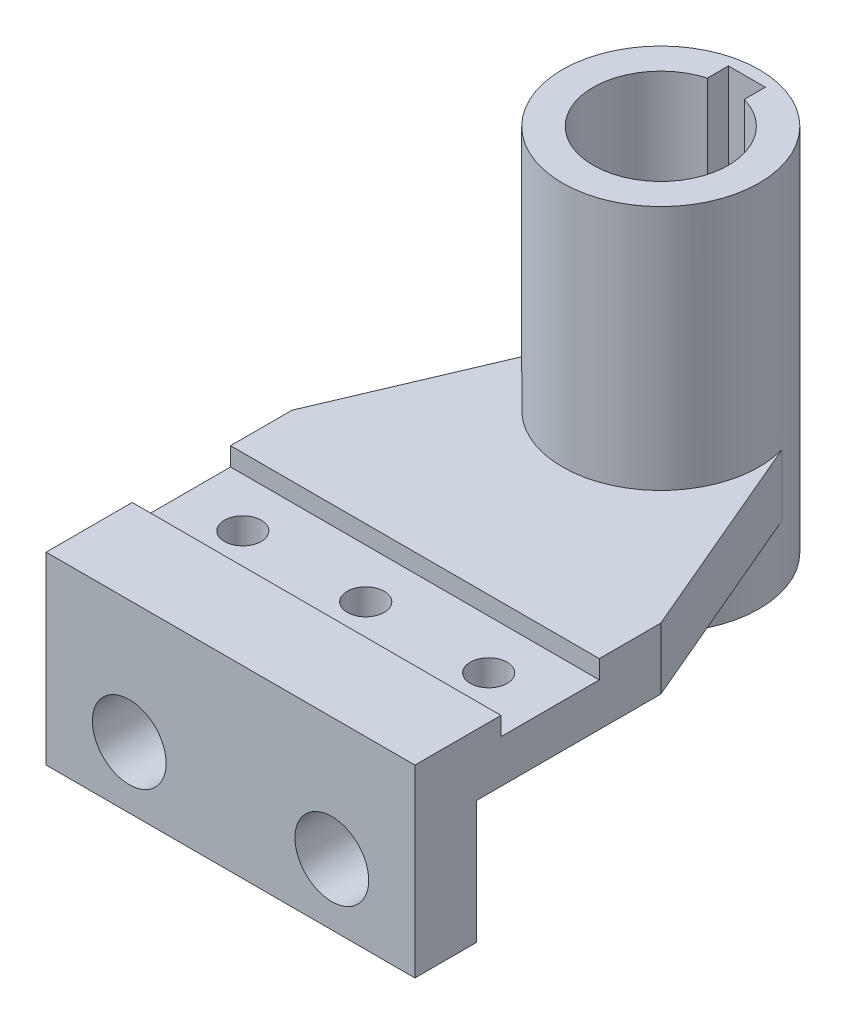
ISO-10303-21;
HEADER;
FILE_DESCRIPTION(('STEP AP214'),'2;1');
FILE_NAME('part.step','',(''),(''),'','','');
FILE_SCHEMA(('AUTOMOTIVE_DESIGN { 1 0 10303 214 1 1 1 1 }'));
ENDSEC;
DATA;
#1=APPLICATION_CONTEXT('core data for automotive mechanical design processes');
#2=APPLICATION_PROTOCOL_DEFINITION('international standard','automotive_design',2000,#1);
#3=PRODUCT_CONTEXT('',#1,'mechanical');
#4=PRODUCT('Part','Part','',(#3));
#5=PRODUCT_RELATED_PRODUCT_CATEGORY('part','',(#4));
#6=PRODUCT_DEFINITION_FORMATION('','',#4);
#7=PRODUCT_DEFINITION_CONTEXT('part definition',#1,'design');
#8=PRODUCT_DEFINITION('design','',#6,#7);
#9=PRODUCT_DEFINITION_SHAPE('','',#8);
#10=(LENGTH_UNIT() NAMED_UNIT(*) SI_UNIT(.MILLI.,.METRE.));
#11=(NAMED_UNIT(*) PLANE_ANGLE_UNIT() SI_UNIT($,.RADIAN.));
#12=(NAMED_UNIT(*) SI_UNIT($,.STERADIAN.) SOLID_ANGLE_UNIT());
#13=UNCERTAINTY_MEASURE_WITH_UNIT(LENGTH_MEASURE(1.E-05),#10,'distance_accuracy_value','');
#14=(GEOMETRIC_REPRESENTATION_CONTEXT(3) GLOBAL_UNCERTAINTY_ASSIGNED_CONTEXT((#13)) GLOBAL_UNIT_ASSIGNED_CONTEXT((#10,
#11,#12)) REPRESENTATION_CONTEXT('',''));
#15=CARTESIAN_POINT('',(0.,0.,0.));
#16=DIRECTION('',(0.,0.,1.));
#17=DIRECTION('',(1.,0.,0.));
#18=AXIS2_PLACEMENT_3D('',#15,#16,#17);
#19=CARTESIAN_POINT('',(-30.,10.,0.));
#20=DIRECTION('',(1.,0.,0.));
#21=DIRECTION('',(0.,0.,-1.));
#22=AXIS2_PLACEMENT_3D('',#19,#20,#21);
#23=PLANE('',#22);
#24=DIRECTION('',(0.,1.,0.));
#25=VECTOR('',#24,1.);
#26=CARTESIAN_POINT('',(-30.,7.,9.99999999999997));
#27=LINE('',#26,#25);
#28=CARTESIAN_POINT('',(-30.,7.,9.99999999999997));
#29=VERTEX_POINT('',#28);
#30=CARTESIAN_POINT('',(-30.,10.,9.99999999999997));
#31=VERTEX_POINT('',#30);
#32=EDGE_CURVE('E203',#29,#31,#27,.T.);
#33=ORIENTED_EDGE('',*,*,#32,.T.);
#34=DIRECTION('',(0.,0.,1.));
#35=VECTOR('',#34,1.);
#36=CARTESIAN_POINT('',(-30.,10.,0.));
#37=LINE('',#36,#35);
#38=CARTESIAN_POINT('',(-30.,10.,0.));
#39=VERTEX_POINT('',#38);
#40=EDGE_CURVE('E297',#39,#31,#37,.T.);
#41=ORIENTED_EDGE('',*,*,#40,.F.);
#42=DIRECTION('',(0.,-1.,0.));
#43=VECTOR('',#42,1.);
#44=CARTESIAN_POINT('',(-30.,10.,0.));
#45=LINE('',#44,#43);
#46=CARTESIAN_POINT('',(-30.,0.,0.));
#47=VERTEX_POINT('',#46);
#48=EDGE_CURVE('E311',#39,#47,#45,.T.);
#49=ORIENTED_EDGE('',*,*,#48,.T.);
#50=DIRECTION('',(0.,0.,1.));
#51=VECTOR('',#50,1.);
#52=CARTESIAN_POINT('',(-30.,0.,0.));
#53=LINE('',#52,#51);
#54=CARTESIAN_POINT('',(-30.,0.,30.));
#55=VERTEX_POINT('',#54);
#56=EDGE_CURVE('E296',#47,#55,#53,.T.);
#57=ORIENTED_EDGE('',*,*,#56,.T.);
#58=DIRECTION('',(0.,1.,0.));
#59=VECTOR('',#58,1.);
#60=CARTESIAN_POINT('',(-30.,-20.,30.));
#61=LINE('',#60,#59);
#62=CARTESIAN_POINT('',(-30.,-20.,30.));
#63=VERTEX_POINT('',#62);
#64=EDGE_CURVE('E253',#63,#55,#61,.T.);
#65=ORIENTED_EDGE('',*,*,#64,.F.);
#66=DIRECTION('',(0.,0.,-1.));
#67=VECTOR('',#66,1.);
#68=CARTESIAN_POINT('',(-30.,-20.,40.));
#69=LINE('',#68,#67);
#70=CARTESIAN_POINT('',(-30.,-20.,40.));
#71=VERTEX_POINT('',#70);
#72=EDGE_CURVE('E245',#71,#63,#69,.T.);
#73=ORIENTED_EDGE('',*,*,#72,.F.);
#74=DIRECTION('',(0.,-1.,0.));
#75=VECTOR('',#74,1.);
#76=CARTESIAN_POINT('',(-30.,10.,40.));
#77=LINE('',#76,#75);
#78=CARTESIAN_POINT('',(-30.,10.,40.));
#79=VERTEX_POINT('',#78);
#80=EDGE_CURVE('E92',#79,#71,#77,.T.);
#81=ORIENTED_EDGE('',*,*,#80,.F.);
#82=CARTESIAN_POINT('',(-30.,10.,26.));
#83=VERTEX_POINT('',#82);
#84=EDGE_CURVE('E301',#83,#79,#37,.T.);
#85=ORIENTED_EDGE('',*,*,#84,.F.);
#86=DIRECTION('',(0.,1.,0.));
#87=VECTOR('',#86,1.);
#88=CARTESIAN_POINT('',(-30.,7.,26.));
#89=LINE('',#88,#87);
#90=CARTESIAN_POINT('',(-30.,7.,26.));
#91=VERTEX_POINT('',#90);
#92=EDGE_CURVE('E99',#91,#83,#89,.T.);
#93=ORIENTED_EDGE('',*,*,#92,.F.);
#94=DIRECTION('',(0.,0.,1.));
#95=VECTOR('',#94,1.);
#96=CARTESIAN_POINT('',(-30.,7.,9.99999999999997));
#97=LINE('',#96,#95);
#98=EDGE_CURVE('E354',#29,#91,#97,.T.);
#99=ORIENTED_EDGE('',*,*,#98,.F.);
#100=EDGE_LOOP('',(#33,#41,#49,#57,#65,#73,#81,#85,#93,#99));
#101=FACE_BOUND('',#100,.T.);
#102=ADVANCED_FACE('F85',(#101),#23,.F.);
#103=CARTESIAN_POINT('',(30.,10.,0.));
#104=DIRECTION('',(-1.,0.,0.));
#105=DIRECTION('',(0.,0.,1.));
#106=AXIS2_PLACEMENT_3D('',#103,#104,#105);
#107=PLANE('',#106);
#108=DIRECTION('',(0.,1.,0.));
#109=VECTOR('',#108,1.);
#110=CARTESIAN_POINT('',(30.,7.,9.99999999999997));
#111=LINE('',#110,#109);
#112=CARTESIAN_POINT('',(30.,7.,9.99999999999997));
#113=VERTEX_POINT('',#112);
#114=CARTESIAN_POINT('',(30.,10.,9.99999999999997));
#115=VERTEX_POINT('',#114);
#116=EDGE_CURVE('E200',#113,#115,#111,.T.);
#117=ORIENTED_EDGE('',*,*,#116,.F.);
#118=DIRECTION('',(0.,0.,-1.));
#119=VECTOR('',#118,1.);
#120=CARTESIAN_POINT('',(30.,7.,26.));
#121=LINE('',#120,#119);
#122=CARTESIAN_POINT('',(30.,7.,26.));
#123=VERTEX_POINT('',#122);
#124=EDGE_CURVE('E207',#123,#113,#121,.T.);
#125=ORIENTED_EDGE('',*,*,#124,.F.);
#126=DIRECTION('',(0.,1.,0.));
#127=VECTOR('',#126,1.);
#128=CARTESIAN_POINT('',(30.,7.,26.));
#129=LINE('',#128,#127);
#130=CARTESIAN_POINT('',(30.,10.,26.));
#131=VERTEX_POINT('',#130);
#132=EDGE_CURVE('E223',#123,#131,#129,.T.);
#133=ORIENTED_EDGE('',*,*,#132,.T.);
#134=DIRECTION('',(0.,0.,-1.));
#135=VECTOR('',#134,1.);
#136=CARTESIAN_POINT('',(30.,10.,0.));
#137=LINE('',#136,#135);
#138=CARTESIAN_POINT('',(30.,10.,40.));
#139=VERTEX_POINT('',#138);
#140=EDGE_CURVE('E303',#139,#131,#137,.T.);
#141=ORIENTED_EDGE('',*,*,#140,.F.);
#142=DIRECTION('',(0.,-1.,0.));
#143=VECTOR('',#142,1.);
#144=CARTESIAN_POINT('',(30.,10.,40.));
#145=LINE('',#144,#143);
#146=CARTESIAN_POINT('',(30.,-20.,40.));
#147=VERTEX_POINT('',#146);
#148=EDGE_CURVE('E331',#139,#147,#145,.T.);
#149=ORIENTED_EDGE('',*,*,#148,.T.);
#150=DIRECTION('',(0.,0.,1.));
#151=VECTOR('',#150,1.);
#152=CARTESIAN_POINT('',(30.,-20.,30.));
#153=LINE('',#152,#151);
#154=CARTESIAN_POINT('',(30.,-20.,30.));
#155=VERTEX_POINT('',#154);
#156=EDGE_CURVE('E239',#155,#147,#153,.T.);
#157=ORIENTED_EDGE('',*,*,#156,.F.);
#158=DIRECTION('',(0.,1.,0.));
#159=VECTOR('',#158,1.);
#160=CARTESIAN_POINT('',(30.,-20.,30.));
#161=LINE('',#160,#159);
#162=CARTESIAN_POINT('',(30.,0.,30.));
#163=VERTEX_POINT('',#162);
#164=EDGE_CURVE('E249',#155,#163,#161,.T.);
#165=ORIENTED_EDGE('',*,*,#164,.T.);
#166=DIRECTION('',(0.,0.,-1.));
#167=VECTOR('',#166,1.);
#168=CARTESIAN_POINT('',(30.,0.,0.));
#169=LINE('',#168,#167);
#170=CARTESIAN_POINT('',(30.,0.,0.));
#171=VERTEX_POINT('',#170);
#172=EDGE_CURVE('E313',#163,#171,#169,.T.);
#173=ORIENTED_EDGE('',*,*,#172,.T.);
#174=DIRECTION('',(0.,-1.,0.));
#175=VECTOR('',#174,1.);
#176=CARTESIAN_POINT('',(30.,10.,0.));
#177=LINE('',#176,#175);
#178=CARTESIAN_POINT('',(30.,10.,0.));
#179=VERTEX_POINT('',#178);
#180=EDGE_CURVE('E328',#179,#171,#177,.T.);
#181=ORIENTED_EDGE('',*,*,#180,.F.);
#182=EDGE_CURVE('E221',#115,#179,#137,.T.);
#183=ORIENTED_EDGE('',*,*,#182,.F.);
#184=EDGE_LOOP('',(#117,#125,#133,#141,#149,#157,#165,#173,#181,#183));
#185=FACE_BOUND('',#184,.T.);
#186=ADVANCED_FACE('F219',(#185),#107,.F.);
#187=CARTESIAN_POINT('',(0.,10.,-30.));
#188=DIRECTION('',(0.,1.,0.));
#189=DIRECTION('',(0.,0.,1.));
#190=AXIS2_PLACEMENT_3D('',#187,#188,#189);
#191=PLANE('',#190);
#192=ORIENTED_EDGE('',*,*,#40,.T.);
#193=DIRECTION('',(1.,0.,0.));
#194=VECTOR('',#193,1.);
#195=CARTESIAN_POINT('',(-30.,10.,9.99999999999997));
#196=LINE('',#195,#194);
#197=EDGE_CURVE('E358',#31,#115,#196,.T.);
#198=ORIENTED_EDGE('',*,*,#197,.T.);
#199=ORIENTED_EDGE('',*,*,#182,.T.);
#200=DIRECTION('',(-0.391393689662936,0.,-0.920223331421255));
#201=VECTOR('',#200,1.);
#202=CARTESIAN_POINT('',(15.4113514572953,10.,-34.3000286347562));
#203=LINE('',#202,#201);
#204=CARTESIAN_POINT('',(15.4113514572953,10.,-34.3000286347562));
#205=VERTEX_POINT('',#204);
#206=EDGE_CURVE('E306',#179,#205,#203,.T.);
#207=ORIENTED_EDGE('',*,*,#206,.T.);
#208=CARTESIAN_POINT('',(0.,10.,-30.));
#209=DIRECTION('',(0.,1.,0.));
#210=DIRECTION('',(0.,0.,1.));
#211=AXIS2_PLACEMENT_3D('',#208,#209,#210);
#212=CIRCLE('',#211,16.);
#213=CARTESIAN_POINT('',(-15.4113514572953,10.,-34.3000286347562));
#214=VERTEX_POINT('',#213);
#215=EDGE_CURVE('E293',#214,#205,#212,.T.);
#216=ORIENTED_EDGE('',*,*,#215,.F.);
#217=DIRECTION('',(-0.391393689662936,0.,0.920223331421255));
#218=VECTOR('',#217,1.);
#219=CARTESIAN_POINT('',(-30.,10.,0.));
#220=LINE('',#219,#218);
#221=EDGE_CURVE('E309',#214,#39,#220,.T.);
#222=ORIENTED_EDGE('',*,*,#221,.T.);
#223=EDGE_LOOP('',(#192,#198,#199,#207,#216,#222));
#224=FACE_BOUND('',#223,.T.);
#225=ADVANCED_FACE('F415',(#224),#191,.T.);
#226=DIRECTION('',(1.,0.,0.));
#227=VECTOR('',#226,1.);
#228=CARTESIAN_POINT('',(-30.,10.,26.));
#229=LINE('',#228,#227);
#230=EDGE_CURVE('E208',#83,#131,#229,.T.);
#231=ORIENTED_EDGE('',*,*,#230,.F.);
#232=ORIENTED_EDGE('',*,*,#84,.T.);
#233=DIRECTION('',(1.,0.,0.));
#234=VECTOR('',#233,1.);
#235=CARTESIAN_POINT('',(-30.,10.,40.));
#236=LINE('',#235,#234);
#237=EDGE_CURVE('E300',#79,#139,#236,.T.);
#238=ORIENTED_EDGE('',*,*,#237,.T.);
#239=ORIENTED_EDGE('',*,*,#140,.T.);
#240=EDGE_LOOP('',(#231,#232,#238,#239));
#241=FACE_BOUND('',#240,.T.);
#242=ADVANCED_FACE('F353',(#241),#191,.T.);
#243=CARTESIAN_POINT('',(-30.,10.,40.));
#244=DIRECTION('',(0.,0.,-1.));
#245=DIRECTION('',(-1.,0.,0.));
#246=AXIS2_PLACEMENT_3D('',#243,#244,#245);
#247=PLANE('',#246);
#248=CARTESIAN_POINT('',(-16.4773015378001,-10.,40.));
#249=DIRECTION('',(0.,0.,1.));
#250=DIRECTION('',(1.,0.,0.));
#251=AXIS2_PLACEMENT_3D('',#248,#249,#250);
#252=CIRCLE('',#251,6.);
#253=CARTESIAN_POINT('',(-10.4773015378001,-10.,40.));
#254=VERTEX_POINT('',#253);
#255=EDGE_CURVE('E226',#254,#254,#252,.T.);
#256=ORIENTED_EDGE('',*,*,#255,.F.);
#257=EDGE_LOOP('',(#256));
#258=FACE_BOUND('',#257,.T.);
#259=ORIENTED_EDGE('',*,*,#80,.T.);
#260=DIRECTION('',(-1.,0.,0.));
#261=VECTOR('',#260,1.);
#262=CARTESIAN_POINT('',(30.,-20.,40.));
#263=LINE('',#262,#261);
#264=EDGE_CURVE('E242',#147,#71,#263,.T.);
#265=ORIENTED_EDGE('',*,*,#264,.F.);
#266=ORIENTED_EDGE('',*,*,#148,.F.);
#267=ORIENTED_EDGE('',*,*,#237,.F.);
#268=EDGE_LOOP('',(#259,#265,#266,#267));
#269=FACE_BOUND('',#268,.T.);
#270=CARTESIAN_POINT('',(16.4773015378001,-10.,40.));
#271=DIRECTION('',(0.,0.,1.));
#272=DIRECTION('',(1.,0.,0.));
#273=AXIS2_PLACEMENT_3D('',#270,#271,#272);
#274=CIRCLE('',#273,6.);
#275=CARTESIAN_POINT('',(22.4773015378001,-10.,40.));
#276=VERTEX_POINT('',#275);
#277=EDGE_CURVE('E231',#276,#276,#274,.F.);
#278=ORIENTED_EDGE('',*,*,#277,.T.);
#279=EDGE_LOOP('',(#278));
#280=FACE_BOUND('',#279,.T.);
#281=ADVANCED_FACE('F336',(#258,#269,#280),#247,.F.);
#282=CARTESIAN_POINT('',(30.,-20.,30.));
#283=DIRECTION('',(0.,0.,1.));
#284=DIRECTION('',(1.,0.,0.));
#285=AXIS2_PLACEMENT_3D('',#282,#283,#284);
#286=PLANE('',#285);
#287=CARTESIAN_POINT('',(-16.4773015378001,-10.,30.));
#288=DIRECTION('',(0.,0.,1.));
#289=DIRECTION('',(1.,0.,0.));
#290=AXIS2_PLACEMENT_3D('',#287,#288,#289);
#291=CIRCLE('',#290,6.);
#292=CARTESIAN_POINT('',(-10.4773015378001,-10.,30.));
#293=VERTEX_POINT('',#292);
#294=EDGE_CURVE('E222',#293,#293,#291,.F.);
#295=ORIENTED_EDGE('',*,*,#294,.F.);
#296=EDGE_LOOP('',(#295));
#297=FACE_BOUND('',#296,.T.);
#298=DIRECTION('',(1.,0.,0.));
#299=VECTOR('',#298,1.);
#300=CARTESIAN_POINT('',(30.,0.,30.));
#301=LINE('',#300,#299);
#302=EDGE_CURVE('E107',#55,#163,#301,.T.);
#303=ORIENTED_EDGE('',*,*,#302,.T.);
#304=ORIENTED_EDGE('',*,*,#164,.F.);
#305=DIRECTION('',(1.,0.,0.));
#306=VECTOR('',#305,1.);
#307=CARTESIAN_POINT('',(30.,-20.,30.));
#308=LINE('',#307,#306);
#309=EDGE_CURVE('E247',#63,#155,#308,.T.);
#310=ORIENTED_EDGE('',*,*,#309,.F.);
#311=ORIENTED_EDGE('',*,*,#64,.T.);
#312=EDGE_LOOP('',(#303,#304,#310,#311));
#313=FACE_BOUND('',#312,.T.);
#314=CARTESIAN_POINT('',(16.4773015378001,-10.,30.));
#315=DIRECTION('',(0.,0.,1.));
#316=DIRECTION('',(1.,0.,0.));
#317=AXIS2_PLACEMENT_3D('',#314,#315,#316);
#318=CIRCLE('',#317,6.);
#319=CARTESIAN_POINT('',(22.4773015378001,-10.,30.));
#320=VERTEX_POINT('',#319);
#321=EDGE_CURVE('E234',#320,#320,#318,.T.);
#322=ORIENTED_EDGE('',*,*,#321,.T.);
#323=EDGE_LOOP('',(#322));
#324=FACE_BOUND('',#323,.T.);
#325=ADVANCED_FACE('F349',(#297,#313,#324),#286,.F.);
#326=CARTESIAN_POINT('',(0.,0.,-30.));
#327=DIRECTION('',(0.,1.,0.));
#328=DIRECTION('',(0.,0.,1.));
#329=AXIS2_PLACEMENT_3D('',#326,#327,#328);
#330=PLANE('',#329);
#331=CARTESIAN_POINT('',(-20.,0.,18.));
#332=DIRECTION('',(0.,1.,0.));
#333=DIRECTION('',(0.,0.,1.));
#334=AXIS2_PLACEMENT_3D('',#331,#332,#333);
#335=CIRCLE('',#334,3.);
#336=CARTESIAN_POINT('',(-20.,0.,21.));
#337=VERTEX_POINT('',#336);
#338=EDGE_CURVE('E368',#337,#337,#335,.T.);
#339=ORIENTED_EDGE('',*,*,#338,.T.);
#340=EDGE_LOOP('',(#339));
#341=FACE_BOUND('',#340,.T.);
#342=CARTESIAN_POINT('',(0.,0.,18.));
#343=DIRECTION('',(0.,1.,0.));
#344=DIRECTION('',(0.,0.,1.));
#345=AXIS2_PLACEMENT_3D('',#342,#343,#344);
#346=CIRCLE('',#345,3.);
#347=CARTESIAN_POINT('',(0.,0.,21.));
#348=VERTEX_POINT('',#347);
#349=EDGE_CURVE('E360',#348,#348,#346,.T.);
#350=ORIENTED_EDGE('',*,*,#349,.T.);
#351=EDGE_LOOP('',(#350));
#352=FACE_BOUND('',#351,.T.);
#353=CARTESIAN_POINT('',(20.,0.,18.));
#354=DIRECTION('',(0.,1.,0.));
#355=DIRECTION('',(0.,0.,1.));
#356=AXIS2_PLACEMENT_3D('',#353,#354,#355);
#357=CIRCLE('',#356,3.);
#358=CARTESIAN_POINT('',(20.,0.,21.));
#359=VERTEX_POINT('',#358);
#360=EDGE_CURVE('E374',#359,#359,#357,.T.);
#361=ORIENTED_EDGE('',*,*,#360,.T.);
#362=EDGE_LOOP('',(#361));
#363=FACE_BOUND('',#362,.T.);
#364=ORIENTED_EDGE('',*,*,#302,.F.);
#365=ORIENTED_EDGE('',*,*,#56,.F.);
#366=DIRECTION('',(-0.391393689662936,0.,0.920223331421255));
#367=VECTOR('',#366,1.);
#368=CARTESIAN_POINT('',(-30.,0.,0.));
#369=LINE('',#368,#367);
#370=CARTESIAN_POINT('',(-15.4113514572953,0.,-34.3000286347562));
#371=VERTEX_POINT('',#370);
#372=EDGE_CURVE('E318',#371,#47,#369,.T.);
#373=ORIENTED_EDGE('',*,*,#372,.F.);
#374=CARTESIAN_POINT('',(0.,0.,-30.));
#375=DIRECTION('',(0.,1.,0.));
#376=DIRECTION('',(0.,0.,1.));
#377=AXIS2_PLACEMENT_3D('',#374,#375,#376);
#378=CIRCLE('',#377,16.);
#379=CARTESIAN_POINT('',(15.4113514572953,0.,-34.3000286347562));
#380=VERTEX_POINT('',#379);
#381=EDGE_CURVE('E12',#371,#380,#378,.T.);
#382=ORIENTED_EDGE('',*,*,#381,.T.);
#383=DIRECTION('',(-0.391393689662936,0.,-0.920223331421255));
#384=VECTOR('',#383,1.);
#385=CARTESIAN_POINT('',(15.4113514572953,0.,-34.3000286347562));
#386=LINE('',#385,#384);
#387=EDGE_CURVE('E315',#171,#380,#386,.T.);
#388=ORIENTED_EDGE('',*,*,#387,.F.);
#389=ORIENTED_EDGE('',*,*,#172,.F.);
#390=EDGE_LOOP('',(#364,#365,#373,#382,#388,#389));
#391=FACE_BOUND('',#390,.T.);
#392=ADVANCED_FACE('F397',(#341,#352,#363,#391),#330,.F.);
#393=CARTESIAN_POINT('',(15.4113514572953,10.,-34.3000286347562));
#394=DIRECTION('',(-0.920223331421255,0.,0.391393689662937));
#395=DIRECTION('',(0.391393689662937,0.,0.920223331421255));
#396=AXIS2_PLACEMENT_3D('',#393,#394,#395);
#397=PLANE('',#396);
#398=ORIENTED_EDGE('',*,*,#387,.T.);
#399=DIRECTION('',(0.,-1.,0.));
#400=VECTOR('',#399,1.);
#401=CARTESIAN_POINT('',(15.4113514572953,10.,-34.3000286347562));
#402=LINE('',#401,#400);
#403=EDGE_CURVE('E325',#205,#380,#402,.T.);
#404=ORIENTED_EDGE('',*,*,#403,.F.);
#405=ORIENTED_EDGE('',*,*,#206,.F.);
#406=ORIENTED_EDGE('',*,*,#180,.T.);
#407=EDGE_LOOP('',(#398,#404,#405,#406));
#408=FACE_BOUND('',#407,.T.);
#409=ADVANCED_FACE('F400',(#408),#397,.F.);
#410=CARTESIAN_POINT('',(0.,10.,-30.));
#411=DIRECTION('',(0.,-1.,0.));
#412=DIRECTION('',(0.,0.,-1.));
#413=AXIS2_PLACEMENT_3D('',#410,#411,#412);
#414=CYLINDRICAL_SURFACE('',#413,16.);
#415=ORIENTED_EDGE('',*,*,#403,.T.);
#416=ORIENTED_EDGE('',*,*,#381,.F.);
#417=DIRECTION('',(0.,-1.,0.));
#418=VECTOR('',#417,1.);
#419=CARTESIAN_POINT('',(-15.4113514572953,10.,-34.3000286347562));
#420=LINE('',#419,#418);
#421=EDGE_CURVE('E322',#214,#371,#420,.T.);
#422=ORIENTED_EDGE('',*,*,#421,.F.);
#423=ORIENTED_EDGE('',*,*,#215,.T.);
#424=EDGE_LOOP('',(#415,#416,#422,#423));
#425=FACE_BOUND('',#424,.T.);
#426=CARTESIAN_POINT('',(0.,-10.,-30.));
#427=DIRECTION('',(0.,1.,0.));
#428=DIRECTION('',(0.,0.,1.));
#429=AXIS2_PLACEMENT_3D('',#426,#427,#428);
#430=CIRCLE('',#429,16.);
#431=CARTESIAN_POINT('',(0.,-10.,-14.));
#432=VERTEX_POINT('',#431);
#433=EDGE_CURVE('E290',#432,#432,#430,.T.);
#434=ORIENTED_EDGE('',*,*,#433,.T.);
#435=EDGE_LOOP('',(#434));
#436=FACE_BOUND('',#435,.T.);
#437=CARTESIAN_POINT('',(0.,50.,-30.));
#438=DIRECTION('',(0.,1.,0.));
#439=DIRECTION('',(0.,0.,1.));
#440=AXIS2_PLACEMENT_3D('',#437,#438,#439);
#441=CIRCLE('',#440,16.);
#442=CARTESIAN_POINT('',(0.,50.,-14.));
#443=VERTEX_POINT('',#442);
#444=EDGE_CURVE('E281',#443,#443,#441,.T.);
#445=ORIENTED_EDGE('',*,*,#444,.F.);
#446=EDGE_LOOP('',(#445));
#447=FACE_BOUND('',#446,.T.);
#448=ADVANCED_FACE('F474',(#425,#436,#447),#414,.T.);
#449=CARTESIAN_POINT('',(-30.,10.,0.));
#450=DIRECTION('',(0.920223331421255,0.,0.391393689662936));
#451=DIRECTION('',(0.391393689662936,0.,-0.920223331421255));
#452=AXIS2_PLACEMENT_3D('',#449,#450,#451);
#453=PLANE('',#452);
#454=ORIENTED_EDGE('',*,*,#372,.T.);
#455=ORIENTED_EDGE('',*,*,#48,.F.);
#456=ORIENTED_EDGE('',*,*,#221,.F.);
#457=ORIENTED_EDGE('',*,*,#421,.T.);
#458=EDGE_LOOP('',(#454,#455,#456,#457));
#459=FACE_BOUND('',#458,.T.);
#460=ADVANCED_FACE('F470',(#459),#453,.F.);
#461=CARTESIAN_POINT('',(0.,-10.,0.));
#462=DIRECTION('',(0.,1.,0.));
#463=DIRECTION('',(0.,0.,1.));
#464=AXIS2_PLACEMENT_3D('',#461,#462,#463);
#465=PLANE('',#464);
#466=DIRECTION('',(1.,0.,0.));
#467=VECTOR('',#466,1.);
#468=CARTESIAN_POINT('',(-3.,-10.,-44.));
#469=LINE('',#468,#467);
#470=CARTESIAN_POINT('',(-3.,-10.,-44.));
#471=VERTEX_POINT('',#470);
#472=CARTESIAN_POINT('',(3.,-10.,-44.));
#473=VERTEX_POINT('',#472);
#474=EDGE_CURVE('E267',#471,#473,#469,.T.);
#475=ORIENTED_EDGE('',*,*,#474,.F.);
#476=DIRECTION('',(0.,0.,1.));
#477=VECTOR('',#476,1.);
#478=CARTESIAN_POINT('',(-3.,-10.,-44.));
#479=LINE('',#478,#477);
#480=CARTESIAN_POINT('',(-3.,-10.,-40.5830052442584));
#481=VERTEX_POINT('',#480);
#482=EDGE_CURVE('E257',#471,#481,#479,.T.);
#483=ORIENTED_EDGE('',*,*,#482,.T.);
#484=CARTESIAN_POINT('',(0.,-10.,-30.));
#485=DIRECTION('',(0.,1.,0.));
#486=DIRECTION('',(0.,0.,1.));
#487=AXIS2_PLACEMENT_3D('',#484,#485,#486);
#488=CIRCLE('',#487,11.);
#489=CARTESIAN_POINT('',(3.,-10.,-40.5830052442584));
#490=VERTEX_POINT('',#489);
#491=EDGE_CURVE('E260',#481,#490,#488,.T.);
#492=ORIENTED_EDGE('',*,*,#491,.T.);
#493=DIRECTION('',(0.,0.,1.));
#494=VECTOR('',#493,1.);
#495=CARTESIAN_POINT('',(3.,-10.,-44.));
#496=LINE('',#495,#494);
#497=EDGE_CURVE('E264',#473,#490,#496,.T.);
#498=ORIENTED_EDGE('',*,*,#497,.F.);
#499=EDGE_LOOP('',(#475,#483,#492,#498));
#500=FACE_BOUND('',#499,.T.);
#501=ORIENTED_EDGE('',*,*,#433,.F.);
#502=EDGE_LOOP('',(#501));
#503=FACE_BOUND('',#502,.T.);
#504=ADVANCED_FACE('F467',(#500,#503),#465,.F.);
#505=CARTESIAN_POINT('',(0.,50.,0.));
#506=DIRECTION('',(0.,1.,0.));
#507=DIRECTION('',(0.,0.,1.));
#508=AXIS2_PLACEMENT_3D('',#505,#506,#507);
#509=PLANE('',#508);
#510=DIRECTION('',(0.,0.,1.));
#511=VECTOR('',#510,1.);
#512=CARTESIAN_POINT('',(-3.,50.,-44.));
#513=LINE('',#512,#511);
#514=CARTESIAN_POINT('',(-3.,50.,-44.));
#515=VERTEX_POINT('',#514);
#516=CARTESIAN_POINT('',(-3.,50.,-40.5830052442584));
#517=VERTEX_POINT('',#516);
#518=EDGE_CURVE('E256',#515,#517,#513,.T.);
#519=ORIENTED_EDGE('',*,*,#518,.F.);
#520=DIRECTION('',(1.,0.,0.));
#521=VECTOR('',#520,1.);
#522=CARTESIAN_POINT('',(-3.,50.,-44.));
#523=LINE('',#522,#521);
#524=CARTESIAN_POINT('',(3.,50.,-44.));
#525=VERTEX_POINT('',#524);
#526=EDGE_CURVE('E261',#515,#525,#523,.T.);
#527=ORIENTED_EDGE('',*,*,#526,.T.);
#528=DIRECTION('',(0.,0.,1.));
#529=VECTOR('',#528,1.);
#530=CARTESIAN_POINT('',(3.,50.,-44.));
#531=LINE('',#530,#529);
#532=CARTESIAN_POINT('',(3.,50.,-40.5830052442584));
#533=VERTEX_POINT('',#532);
#534=EDGE_CURVE('E274',#525,#533,#531,.T.);
#535=ORIENTED_EDGE('',*,*,#534,.T.);
#536=CARTESIAN_POINT('',(0.,50.,-30.));
#537=DIRECTION('',(0.,1.,0.));
#538=DIRECTION('',(0.,0.,1.));
#539=AXIS2_PLACEMENT_3D('',#536,#537,#538);
#540=CIRCLE('',#539,11.);
#541=EDGE_CURVE('E271',#517,#533,#540,.T.);
#542=ORIENTED_EDGE('',*,*,#541,.F.);
#543=EDGE_LOOP('',(#519,#527,#535,#542));
#544=FACE_BOUND('',#543,.T.);
#545=ORIENTED_EDGE('',*,*,#444,.T.);
#546=EDGE_LOOP('',(#545));
#547=FACE_BOUND('',#546,.T.);
#548=ADVANCED_FACE('F463',(#544,#547),#509,.T.);
#549=CARTESIAN_POINT('',(-3.,-10.,-44.));
#550=DIRECTION('',(-1.,0.,0.));
#551=DIRECTION('',(0.,0.,1.));
#552=AXIS2_PLACEMENT_3D('',#549,#550,#551);
#553=PLANE('',#552);
#554=ORIENTED_EDGE('',*,*,#518,.T.);
#555=DIRECTION('',(0.,1.,0.));
#556=VECTOR('',#555,1.);
#557=CARTESIAN_POINT('',(-3.,-10.,-40.5830052442584));
#558=LINE('',#557,#556);
#559=EDGE_CURVE('E269',#481,#517,#558,.T.);
#560=ORIENTED_EDGE('',*,*,#559,.F.);
#561=ORIENTED_EDGE('',*,*,#482,.F.);
#562=DIRECTION('',(0.,1.,0.));
#563=VECTOR('',#562,1.);
#564=CARTESIAN_POINT('',(-3.,-10.,-44.));
#565=LINE('',#564,#563);
#566=EDGE_CURVE('E279',#471,#515,#565,.T.);
#567=ORIENTED_EDGE('',*,*,#566,.T.);
#568=EDGE_LOOP('',(#554,#560,#561,#567));
#569=FACE_BOUND('',#568,.T.);
#570=ADVANCED_FACE('F453',(#569),#553,.F.);
#571=CARTESIAN_POINT('',(-3.,-10.,-44.));
#572=DIRECTION('',(0.,0.,1.));
#573=DIRECTION('',(1.,0.,0.));
#574=AXIS2_PLACEMENT_3D('',#571,#572,#573);
#575=PLANE('',#574);
#576=ORIENTED_EDGE('',*,*,#526,.F.);
#577=ORIENTED_EDGE('',*,*,#566,.F.);
#578=ORIENTED_EDGE('',*,*,#474,.T.);
#579=DIRECTION('',(0.,1.,0.));
#580=VECTOR('',#579,1.);
#581=CARTESIAN_POINT('',(3.,-10.,-44.));
#582=LINE('',#581,#580);
#583=EDGE_CURVE('E282',#473,#525,#582,.T.);
#584=ORIENTED_EDGE('',*,*,#583,.T.);
#585=EDGE_LOOP('',(#576,#577,#578,#584));
#586=FACE_BOUND('',#585,.T.);
#587=ADVANCED_FACE('F449',(#586),#575,.T.);
#588=CARTESIAN_POINT('',(3.,-10.,-44.));
#589=DIRECTION('',(-1.,0.,0.));
#590=DIRECTION('',(0.,0.,1.));
#591=AXIS2_PLACEMENT_3D('',#588,#589,#590);
#592=PLANE('',#591);
#593=ORIENTED_EDGE('',*,*,#534,.F.);
#594=ORIENTED_EDGE('',*,*,#583,.F.);
#595=ORIENTED_EDGE('',*,*,#497,.T.);
#596=DIRECTION('',(0.,1.,0.));
#597=VECTOR('',#596,1.);
#598=CARTESIAN_POINT('',(3.,-10.,-40.5830052442584));
#599=LINE('',#598,#597);
#600=EDGE_CURVE('E284',#490,#533,#599,.T.);
#601=ORIENTED_EDGE('',*,*,#600,.T.);
#602=EDGE_LOOP('',(#593,#594,#595,#601));
#603=FACE_BOUND('',#602,.T.);
#604=ADVANCED_FACE('F452',(#603),#592,.T.);
#605=CARTESIAN_POINT('',(0.,-10.,-30.));
#606=DIRECTION('',(0.,1.,0.));
#607=DIRECTION('',(0.,0.,1.));
#608=AXIS2_PLACEMENT_3D('',#605,#606,#607);
#609=CYLINDRICAL_SURFACE('',#608,11.);
#610=ORIENTED_EDGE('',*,*,#541,.T.);
#611=ORIENTED_EDGE('',*,*,#600,.F.);
#612=ORIENTED_EDGE('',*,*,#491,.F.);
#613=ORIENTED_EDGE('',*,*,#559,.T.);
#614=EDGE_LOOP('',(#610,#611,#612,#613));
#615=FACE_BOUND('',#614,.T.);
#616=ADVANCED_FACE('F445',(#615),#609,.F.);
#617=CARTESIAN_POINT('',(0.,-20.,0.));
#618=DIRECTION('',(0.,-1.,0.));
#619=DIRECTION('',(0.,0.,-1.));
#620=AXIS2_PLACEMENT_3D('',#617,#618,#619);
#621=PLANE('',#620);
#622=ORIENTED_EDGE('',*,*,#156,.T.);
#623=ORIENTED_EDGE('',*,*,#264,.T.);
#624=ORIENTED_EDGE('',*,*,#72,.T.);
#625=ORIENTED_EDGE('',*,*,#309,.T.);
#626=EDGE_LOOP('',(#622,#623,#624,#625));
#627=FACE_BOUND('',#626,.T.);
#628=ADVANCED_FACE('F343',(#627),#621,.T.);
#629=CARTESIAN_POINT('',(-16.4773015378001,-10.,-46.001));
#630=DIRECTION('',(0.,0.,1.));
#631=DIRECTION('',(1.,0.,0.));
#632=AXIS2_PLACEMENT_3D('',#629,#630,#631);
#633=CYLINDRICAL_SURFACE('',#632,6.);
#634=ORIENTED_EDGE('',*,*,#255,.T.);
#635=EDGE_LOOP('',(#634));
#636=FACE_BOUND('',#635,.T.);
#637=ORIENTED_EDGE('',*,*,#294,.T.);
#638=EDGE_LOOP('',(#637));
#639=FACE_BOUND('',#638,.T.);
#640=ADVANCED_FACE('F434',(#636,#639),#633,.F.);
#641=CARTESIAN_POINT('',(16.4773015378001,-10.,-46.001));
#642=DIRECTION('',(0.,0.,1.));
#643=DIRECTION('',(1.,0.,0.));
#644=AXIS2_PLACEMENT_3D('',#641,#642,#643);
#645=CYLINDRICAL_SURFACE('',#644,6.);
#646=ORIENTED_EDGE('',*,*,#277,.F.);
#647=EDGE_LOOP('',(#646));
#648=FACE_BOUND('',#647,.T.);
#649=ORIENTED_EDGE('',*,*,#321,.F.);
#650=EDGE_LOOP('',(#649));
#651=FACE_BOUND('',#650,.T.);
#652=ADVANCED_FACE('F386',(#648,#651),#645,.F.);
#653=CARTESIAN_POINT('',(0.,7.,0.));
#654=DIRECTION('',(0.,1.,0.));
#655=DIRECTION('',(0.,0.,1.));
#656=AXIS2_PLACEMENT_3D('',#653,#654,#655);
#657=PLANE('',#656);
#658=CARTESIAN_POINT('',(20.,7.,18.));
#659=DIRECTION('',(0.,1.,0.));
#660=DIRECTION('',(0.,0.,1.));
#661=AXIS2_PLACEMENT_3D('',#658,#659,#660);
#662=CIRCLE('',#661,3.);
#663=CARTESIAN_POINT('',(20.,7.,21.));
#664=VERTEX_POINT('',#663);
#665=EDGE_CURVE('E377',#664,#664,#662,.T.);
#666=ORIENTED_EDGE('',*,*,#665,.F.);
#667=EDGE_LOOP('',(#666));
#668=FACE_BOUND('',#667,.T.);
#669=CARTESIAN_POINT('',(0.,7.,18.));
#670=DIRECTION('',(0.,1.,0.));
#671=DIRECTION('',(0.,0.,1.));
#672=AXIS2_PLACEMENT_3D('',#669,#670,#671);
#673=CIRCLE('',#672,3.);
#674=CARTESIAN_POINT('',(0.,7.,21.));
#675=VERTEX_POINT('',#674);
#676=EDGE_CURVE('E365',#675,#675,#673,.T.);
#677=ORIENTED_EDGE('',*,*,#676,.F.);
#678=EDGE_LOOP('',(#677));
#679=FACE_BOUND('',#678,.T.);
#680=DIRECTION('',(1.,0.,0.));
#681=VECTOR('',#680,1.);
#682=CARTESIAN_POINT('',(-30.,7.,9.99999999999997));
#683=LINE('',#682,#681);
#684=EDGE_CURVE('E196',#29,#113,#683,.T.);
#685=ORIENTED_EDGE('',*,*,#684,.F.);
#686=ORIENTED_EDGE('',*,*,#98,.T.);
#687=DIRECTION('',(1.,0.,0.));
#688=VECTOR('',#687,1.);
#689=CARTESIAN_POINT('',(-30.,7.,26.));
#690=LINE('',#689,#688);
#691=EDGE_CURVE('E214',#91,#123,#690,.T.);
#692=ORIENTED_EDGE('',*,*,#691,.T.);
#693=ORIENTED_EDGE('',*,*,#124,.T.);
#694=EDGE_LOOP('',(#685,#686,#692,#693));
#695=FACE_BOUND('',#694,.T.);
#696=CARTESIAN_POINT('',(-20.,7.,18.));
#697=DIRECTION('',(0.,1.,0.));
#698=DIRECTION('',(0.,0.,1.));
#699=AXIS2_PLACEMENT_3D('',#696,#697,#698);
#700=CIRCLE('',#699,3.);
#701=CARTESIAN_POINT('',(-20.,7.,21.));
#702=VERTEX_POINT('',#701);
#703=EDGE_CURVE('E371',#702,#702,#700,.T.);
#704=ORIENTED_EDGE('',*,*,#703,.F.);
#705=EDGE_LOOP('',(#704));
#706=FACE_BOUND('',#705,.T.);
#707=ADVANCED_FACE('F212',(#668,#679,#695,#706),#657,.T.);
#708=CARTESIAN_POINT('',(-30.,7.,9.99999999999997));
#709=DIRECTION('',(0.,0.,1.));
#710=DIRECTION('',(1.,0.,0.));
#711=AXIS2_PLACEMENT_3D('',#708,#709,#710);
#712=PLANE('',#711);
#713=ORIENTED_EDGE('',*,*,#197,.F.);
#714=ORIENTED_EDGE('',*,*,#32,.F.);
#715=ORIENTED_EDGE('',*,*,#684,.T.);
#716=ORIENTED_EDGE('',*,*,#116,.T.);
#717=EDGE_LOOP('',(#713,#714,#715,#716));
#718=FACE_BOUND('',#717,.T.);
#719=ADVANCED_FACE('F198',(#718),#712,.T.);
#720=CARTESIAN_POINT('',(-30.,7.,26.));
#721=DIRECTION('',(0.,0.,1.));
#722=DIRECTION('',(1.,0.,0.));
#723=AXIS2_PLACEMENT_3D('',#720,#721,#722);
#724=PLANE('',#723);
#725=ORIENTED_EDGE('',*,*,#230,.T.);
#726=ORIENTED_EDGE('',*,*,#132,.F.);
#727=ORIENTED_EDGE('',*,*,#691,.F.);
#728=ORIENTED_EDGE('',*,*,#92,.T.);
#729=EDGE_LOOP('',(#725,#726,#727,#728));
#730=FACE_BOUND('',#729,.T.);
#731=ADVANCED_FACE('F405',(#730),#724,.F.);
#732=CARTESIAN_POINT('',(20.,-20.,18.));
#733=DIRECTION('',(0.,1.,0.));
#734=DIRECTION('',(0.,0.,1.));
#735=AXIS2_PLACEMENT_3D('',#732,#733,#734);
#736=CYLINDRICAL_SURFACE('',#735,3.);
#737=ORIENTED_EDGE('',*,*,#665,.T.);
#738=EDGE_LOOP('',(#737));
#739=FACE_BOUND('',#738,.T.);
#740=ORIENTED_EDGE('',*,*,#360,.F.);
#741=EDGE_LOOP('',(#740));
#742=FACE_BOUND('',#741,.T.);
#743=ADVANCED_FACE('F381',(#739,#742),#736,.F.);
#744=CARTESIAN_POINT('',(0.,-20.,18.));
#745=DIRECTION('',(0.,1.,0.));
#746=DIRECTION('',(0.,0.,1.));
#747=AXIS2_PLACEMENT_3D('',#744,#745,#746);
#748=CYLINDRICAL_SURFACE('',#747,3.);
#749=ORIENTED_EDGE('',*,*,#676,.T.);
#750=EDGE_LOOP('',(#749));
#751=FACE_BOUND('',#750,.T.);
#752=ORIENTED_EDGE('',*,*,#349,.F.);
#753=EDGE_LOOP('',(#752));
#754=FACE_BOUND('',#753,.T.);
#755=ADVANCED_FACE('F390',(#751,#754),#748,.F.);
#756=CARTESIAN_POINT('',(-20.,-20.,18.));
#757=DIRECTION('',(0.,1.,0.));
#758=DIRECTION('',(0.,0.,1.));
#759=AXIS2_PLACEMENT_3D('',#756,#757,#758);
#760=CYLINDRICAL_SURFACE('',#759,3.);
#761=ORIENTED_EDGE('',*,*,#703,.T.);
#762=EDGE_LOOP('',(#761));
#763=FACE_BOUND('',#762,.T.);
#764=ORIENTED_EDGE('',*,*,#338,.F.);
#765=EDGE_LOOP('',(#764));
#766=FACE_BOUND('',#765,.T.);
#767=ADVANCED_FACE('F393',(#763,#766),#760,.F.);
#768=CLOSED_SHELL('',(#102,#186,#225,#242,#281,#325,#392,#409,#448,#460,#504,#548,#570,#587,
#604,#616,#628,#640,#652,#707,#719,#731,#743,#755,#767));
#769=MANIFOLD_SOLID_BREP('B2',#768);
#770=ADVANCED_BREP_SHAPE_REPRESENTATION('',(#18,#769),#14);
#771=SHAPE_DEFINITION_REPRESENTATION(#9,#770);
ENDSEC;
END-ISO-10303-21;
